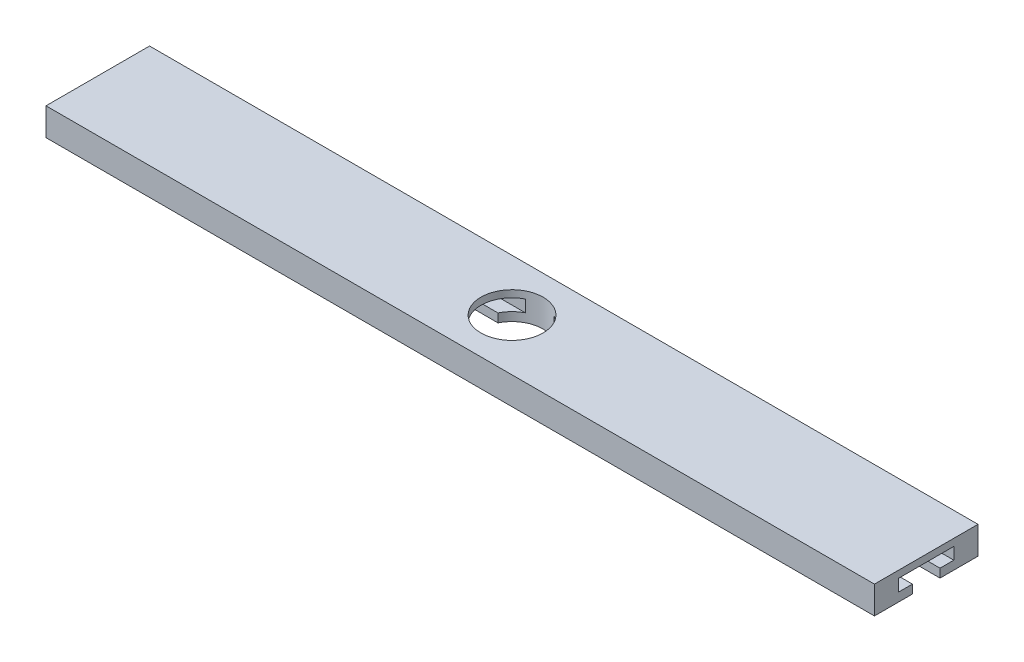
ISO-10303-21;
HEADER;
FILE_DESCRIPTION(('STEP AP214'),'2;1');
FILE_NAME('part.step','',(''),(''),'','','');
FILE_SCHEMA(('AUTOMOTIVE_DESIGN { 1 0 10303 214 1 1 1 1 }'));
ENDSEC;
DATA;
#1=APPLICATION_CONTEXT('core data for automotive mechanical design processes');
#2=APPLICATION_PROTOCOL_DEFINITION('international standard','automotive_design',2000,#1);
#3=PRODUCT_CONTEXT('',#1,'mechanical');
#4=PRODUCT('Part','Part','',(#3));
#5=PRODUCT_RELATED_PRODUCT_CATEGORY('part','',(#4));
#6=PRODUCT_DEFINITION_FORMATION('','',#4);
#7=PRODUCT_DEFINITION_CONTEXT('part definition',#1,'design');
#8=PRODUCT_DEFINITION('design','',#6,#7);
#9=PRODUCT_DEFINITION_SHAPE('','',#8);
#10=(LENGTH_UNIT() NAMED_UNIT(*) SI_UNIT(.MILLI.,.METRE.));
#11=(NAMED_UNIT(*) PLANE_ANGLE_UNIT() SI_UNIT($,.RADIAN.));
#12=(NAMED_UNIT(*) SI_UNIT($,.STERADIAN.) SOLID_ANGLE_UNIT());
#13=UNCERTAINTY_MEASURE_WITH_UNIT(LENGTH_MEASURE(1.E-05),#10,'distance_accuracy_value','');
#14=(GEOMETRIC_REPRESENTATION_CONTEXT(3) GLOBAL_UNCERTAINTY_ASSIGNED_CONTEXT((#13)) GLOBAL_UNIT_ASSIGNED_CONTEXT((#10,
#11,#12)) REPRESENTATION_CONTEXT('',''));
#15=CARTESIAN_POINT('',(0.,0.,0.));
#16=DIRECTION('',(0.,0.,1.));
#17=DIRECTION('',(1.,0.,0.));
#18=AXIS2_PLACEMENT_3D('',#15,#16,#17);
#19=CARTESIAN_POINT('',(27.,30.4474858159156,9.5));
#20=DIRECTION('',(0.,0.,-1.));
#21=DIRECTION('',(-1.,0.,0.));
#22=AXIS2_PLACEMENT_3D('',#19,#20,#21);
#23=PLANE('',#22);
#24=DIRECTION('',(-1.,0.,0.));
#25=VECTOR('',#24,1.);
#26=CARTESIAN_POINT('',(27.,30.4474858159156,9.5));
#27=LINE('',#26,#25);
#28=CARTESIAN_POINT('',(20.7315085104506,30.4474858159156,9.5));
#29=VERTEX_POINT('',#28);
#30=CARTESIAN_POINT('',(-35.2373626154001,30.4474858159156,9.5));
#31=VERTEX_POINT('',#30);
#32=EDGE_CURVE('E180',#29,#31,#27,.T.);
#33=ORIENTED_EDGE('',*,*,#32,.T.);
#34=DIRECTION('',(0.,-1.,0.));
#35=VECTOR('',#34,1.);
#36=CARTESIAN_POINT('',(-35.2373626154001,44.,9.5));
#37=LINE('',#36,#35);
#38=CARTESIAN_POINT('',(-35.2373626154001,31.6992332383739,9.5));
#39=VERTEX_POINT('',#38);
#40=EDGE_CURVE('E170',#31,#39,#37,.F.);
#41=ORIENTED_EDGE('',*,*,#40,.T.);
#42=DIRECTION('',(-1.,0.,0.));
#43=VECTOR('',#42,1.);
#44=CARTESIAN_POINT('',(27.,31.6992332383739,9.5));
#45=LINE('',#44,#43);
#46=CARTESIAN_POINT('',(20.7315085104506,31.6992332383739,9.5));
#47=VERTEX_POINT('',#46);
#48=EDGE_CURVE('E177',#47,#39,#45,.T.);
#49=ORIENTED_EDGE('',*,*,#48,.F.);
#50=DIRECTION('',(0.,-1.,0.));
#51=VECTOR('',#50,1.);
#52=CARTESIAN_POINT('',(20.7315085104506,30.4474858159156,9.5));
#53=LINE('',#52,#51);
#54=EDGE_CURVE('E173',#47,#29,#53,.T.);
#55=ORIENTED_EDGE('',*,*,#54,.T.);
#56=EDGE_LOOP('',(#33,#41,#49,#55));
#57=FACE_BOUND('',#56,.T.);
#58=ADVANCED_FACE('F33',(#57),#23,.T.);
#59=CARTESIAN_POINT('',(-43.2996203636986,31.6992332383739,9.5));
#60=VERTEX_POINT('',#59);
#61=CARTESIAN_POINT('',(-99.2684914895494,31.6992332383739,9.5));
#62=VERTEX_POINT('',#61);
#63=EDGE_CURVE('E188',#60,#62,#45,.T.);
#64=ORIENTED_EDGE('',*,*,#63,.F.);
#65=DIRECTION('',(0.,-1.,0.));
#66=VECTOR('',#65,1.);
#67=CARTESIAN_POINT('',(-43.2996203636986,44.,9.5));
#68=LINE('',#67,#66);
#69=CARTESIAN_POINT('',(-43.2996203636986,30.4474858159156,9.5));
#70=VERTEX_POINT('',#69);
#71=EDGE_CURVE('E304',#60,#70,#68,.T.);
#72=ORIENTED_EDGE('',*,*,#71,.T.);
#73=CARTESIAN_POINT('',(-99.2684914895494,30.4474858159156,9.5));
#74=VERTEX_POINT('',#73);
#75=EDGE_CURVE('E215',#70,#74,#27,.T.);
#76=ORIENTED_EDGE('',*,*,#75,.T.);
#77=DIRECTION('',(0.,1.,0.));
#78=VECTOR('',#77,1.);
#79=CARTESIAN_POINT('',(-99.2684914895493,34.4474858159156,9.5));
#80=LINE('',#79,#78);
#81=EDGE_CURVE('E235',#74,#62,#80,.T.);
#82=ORIENTED_EDGE('',*,*,#81,.T.);
#83=EDGE_LOOP('',(#64,#72,#76,#82));
#84=FACE_BOUND('',#83,.T.);
#85=ADVANCED_FACE('F302',(#84),#23,.T.);
#86=CARTESIAN_POINT('',(27.,31.6992332383739,5.5));
#87=DIRECTION('',(0.,0.,1.));
#88=DIRECTION('',(1.,0.,0.));
#89=AXIS2_PLACEMENT_3D('',#86,#87,#88);
#90=PLANE('',#89);
#91=DIRECTION('',(-1.,0.,0.));
#92=VECTOR('',#91,1.);
#93=CARTESIAN_POINT('',(27.,30.4474858159156,5.5));
#94=LINE('',#93,#92);
#95=CARTESIAN_POINT('',(-43.2996203636986,30.4474858159156,5.5));
#96=VERTEX_POINT('',#95);
#97=CARTESIAN_POINT('',(-99.2684914895494,30.4474858159156,5.5));
#98=VERTEX_POINT('',#97);
#99=EDGE_CURVE('E211',#96,#98,#94,.T.);
#100=ORIENTED_EDGE('',*,*,#99,.F.);
#101=DIRECTION('',(0.,-1.,0.));
#102=VECTOR('',#101,1.);
#103=CARTESIAN_POINT('',(-43.2996203636986,44.,5.5));
#104=LINE('',#103,#102);
#105=CARTESIAN_POINT('',(-43.2996203636986,31.6992332383739,5.5));
#106=VERTEX_POINT('',#105);
#107=EDGE_CURVE('E306',#96,#106,#104,.F.);
#108=ORIENTED_EDGE('',*,*,#107,.T.);
#109=DIRECTION('',(-1.,0.,0.));
#110=VECTOR('',#109,1.);
#111=CARTESIAN_POINT('',(27.,31.6992332383739,5.5));
#112=LINE('',#111,#110);
#113=CARTESIAN_POINT('',(-99.2684914895494,31.6992332383739,5.5));
#114=VERTEX_POINT('',#113);
#115=EDGE_CURVE('E207',#106,#114,#112,.T.);
#116=ORIENTED_EDGE('',*,*,#115,.T.);
#117=DIRECTION('',(0.,-1.,0.));
#118=VECTOR('',#117,1.);
#119=CARTESIAN_POINT('',(-99.2684914895493,34.4474858159156,5.5));
#120=LINE('',#119,#118);
#121=EDGE_CURVE('E232',#114,#98,#120,.T.);
#122=ORIENTED_EDGE('',*,*,#121,.T.);
#123=EDGE_LOOP('',(#100,#108,#116,#122));
#124=FACE_BOUND('',#123,.T.);
#125=ADVANCED_FACE('F372',(#124),#90,.T.);
#126=CARTESIAN_POINT('',(20.7315085104506,31.6992332383739,5.5));
#127=VERTEX_POINT('',#126);
#128=CARTESIAN_POINT('',(-35.2373626154001,31.6992332383739,5.5));
#129=VERTEX_POINT('',#128);
#130=EDGE_CURVE('E208',#127,#129,#112,.T.);
#131=ORIENTED_EDGE('',*,*,#130,.T.);
#132=DIRECTION('',(0.,-1.,0.));
#133=VECTOR('',#132,1.);
#134=CARTESIAN_POINT('',(-35.2373626154001,44.,5.5));
#135=LINE('',#134,#133);
#136=CARTESIAN_POINT('',(-35.2373626154001,30.4474858159156,5.5));
#137=VERTEX_POINT('',#136);
#138=EDGE_CURVE('E182',#129,#137,#135,.T.);
#139=ORIENTED_EDGE('',*,*,#138,.T.);
#140=CARTESIAN_POINT('',(20.7315085104506,30.4474858159156,5.5));
#141=VERTEX_POINT('',#140);
#142=EDGE_CURVE('E212',#141,#137,#94,.T.);
#143=ORIENTED_EDGE('',*,*,#142,.F.);
#144=DIRECTION('',(0.,1.,0.));
#145=VECTOR('',#144,1.);
#146=CARTESIAN_POINT('',(20.7315085104506,30.4474858159156,5.5));
#147=LINE('',#146,#145);
#148=EDGE_CURVE('E280',#141,#127,#147,.T.);
#149=ORIENTED_EDGE('',*,*,#148,.T.);
#150=EDGE_LOOP('',(#131,#139,#143,#149));
#151=FACE_BOUND('',#150,.T.);
#152=ADVANCED_FACE('F353',(#151),#90,.T.);
#153=CARTESIAN_POINT('',(27.,31.6992332383739,3.5));
#154=DIRECTION('',(0.,1.,0.));
#155=DIRECTION('',(0.,0.,1.));
#156=AXIS2_PLACEMENT_3D('',#153,#154,#155);
#157=PLANE('',#156);
#158=ORIENTED_EDGE('',*,*,#115,.F.);
#159=CARTESIAN_POINT('',(-39.2684914895494,31.6992332383739,7.5));
#160=DIRECTION('',(0.,1.,0.));
#161=DIRECTION('',(0.,0.,1.));
#162=AXIS2_PLACEMENT_3D('',#159,#160,#161);
#163=CIRCLE('',#162,4.5);
#164=CARTESIAN_POINT('',(-41.3300443023582,31.6992332383739,3.5));
#165=VERTEX_POINT('',#164);
#166=EDGE_CURVE('E316',#106,#165,#163,.F.);
#167=ORIENTED_EDGE('',*,*,#166,.T.);
#168=DIRECTION('',(-1.,0.,0.));
#169=VECTOR('',#168,1.);
#170=CARTESIAN_POINT('',(27.,31.6992332383739,3.5));
#171=LINE('',#170,#169);
#172=CARTESIAN_POINT('',(-99.2684914895494,31.6992332383739,3.5));
#173=VERTEX_POINT('',#172);
#174=EDGE_CURVE('E203',#165,#173,#171,.T.);
#175=ORIENTED_EDGE('',*,*,#174,.T.);
#176=DIRECTION('',(0.,0.,1.));
#177=VECTOR('',#176,1.);
#178=CARTESIAN_POINT('',(-99.2684914895493,31.6992332383739,15.));
#179=LINE('',#178,#177);
#180=EDGE_CURVE('E229',#173,#114,#179,.T.);
#181=ORIENTED_EDGE('',*,*,#180,.T.);
#182=EDGE_LOOP('',(#158,#167,#175,#181));
#183=FACE_BOUND('',#182,.T.);
#184=ADVANCED_FACE('F375',(#183),#157,.T.);
#185=CARTESIAN_POINT('',(27.,33.4295680375443,3.5));
#186=DIRECTION('',(0.,0.,1.));
#187=DIRECTION('',(1.,0.,0.));
#188=AXIS2_PLACEMENT_3D('',#185,#186,#187);
#189=PLANE('',#188);
#190=ORIENTED_EDGE('',*,*,#174,.F.);
#191=DIRECTION('',(0.,-1.,0.));
#192=VECTOR('',#191,1.);
#193=CARTESIAN_POINT('',(-41.3300443023582,44.,3.5));
#194=LINE('',#193,#192);
#195=CARTESIAN_POINT('',(-41.3300443023582,33.4295680375443,3.5));
#196=VERTEX_POINT('',#195);
#197=EDGE_CURVE('E314',#165,#196,#194,.F.);
#198=ORIENTED_EDGE('',*,*,#197,.T.);
#199=DIRECTION('',(-1.,0.,0.));
#200=VECTOR('',#199,1.);
#201=CARTESIAN_POINT('',(27.,33.4295680375443,3.5));
#202=LINE('',#201,#200);
#203=CARTESIAN_POINT('',(-99.2684914895494,33.4295680375443,3.5));
#204=VERTEX_POINT('',#203);
#205=EDGE_CURVE('E199',#196,#204,#202,.T.);
#206=ORIENTED_EDGE('',*,*,#205,.T.);
#207=DIRECTION('',(0.,-1.,0.));
#208=VECTOR('',#207,1.);
#209=CARTESIAN_POINT('',(-99.2684914895493,34.4474858159156,3.5));
#210=LINE('',#209,#208);
#211=EDGE_CURVE('E226',#204,#173,#210,.T.);
#212=ORIENTED_EDGE('',*,*,#211,.T.);
#213=EDGE_LOOP('',(#190,#198,#206,#212));
#214=FACE_BOUND('',#213,.T.);
#215=ADVANCED_FACE('F376',(#214),#189,.T.);
#216=CARTESIAN_POINT('',(20.7315085104506,33.4295680375443,3.5));
#217=VERTEX_POINT('',#216);
#218=CARTESIAN_POINT('',(-37.2069386767405,33.4295680375443,3.5));
#219=VERTEX_POINT('',#218);
#220=EDGE_CURVE('E200',#217,#219,#202,.T.);
#221=ORIENTED_EDGE('',*,*,#220,.T.);
#222=DIRECTION('',(0.,-1.,0.));
#223=VECTOR('',#222,1.);
#224=CARTESIAN_POINT('',(-37.2069386767405,44.,3.5));
#225=LINE('',#224,#223);
#226=CARTESIAN_POINT('',(-37.2069386767405,31.6992332383739,3.5));
#227=VERTEX_POINT('',#226);
#228=EDGE_CURVE('E331',#219,#227,#225,.T.);
#229=ORIENTED_EDGE('',*,*,#228,.T.);
#230=CARTESIAN_POINT('',(20.7315085104506,31.6992332383739,3.5));
#231=VERTEX_POINT('',#230);
#232=EDGE_CURVE('E204',#231,#227,#171,.T.);
#233=ORIENTED_EDGE('',*,*,#232,.F.);
#234=DIRECTION('',(0.,1.,0.));
#235=VECTOR('',#234,1.);
#236=CARTESIAN_POINT('',(20.7315085104506,30.4474858159156,3.5));
#237=LINE('',#236,#235);
#238=EDGE_CURVE('E276',#231,#217,#237,.T.);
#239=ORIENTED_EDGE('',*,*,#238,.T.);
#240=EDGE_LOOP('',(#221,#229,#233,#239));
#241=FACE_BOUND('',#240,.T.);
#242=ADVANCED_FACE('F346',(#241),#189,.T.);
#243=CARTESIAN_POINT('',(27.,33.4295680375443,11.5));
#244=DIRECTION('',(0.,-1.,0.));
#245=DIRECTION('',(0.,0.,-1.));
#246=AXIS2_PLACEMENT_3D('',#243,#244,#245);
#247=PLANE('',#246);
#248=ORIENTED_EDGE('',*,*,#205,.F.);
#249=CARTESIAN_POINT('',(-39.2684914895494,33.4295680375443,7.5));
#250=DIRECTION('',(0.,-1.,0.));
#251=DIRECTION('',(0.,0.,-1.));
#252=AXIS2_PLACEMENT_3D('',#249,#250,#251);
#253=CIRCLE('',#252,4.5);
#254=CARTESIAN_POINT('',(-41.3300443023582,33.4295680375443,11.5));
#255=VERTEX_POINT('',#254);
#256=EDGE_CURVE('E309',#196,#255,#253,.F.);
#257=ORIENTED_EDGE('',*,*,#256,.T.);
#258=DIRECTION('',(-1.,0.,0.));
#259=VECTOR('',#258,1.);
#260=CARTESIAN_POINT('',(27.,33.4295680375443,11.5));
#261=LINE('',#260,#259);
#262=CARTESIAN_POINT('',(-99.2684914895494,33.4295680375443,11.5));
#263=VERTEX_POINT('',#262);
#264=EDGE_CURVE('E195',#255,#263,#261,.T.);
#265=ORIENTED_EDGE('',*,*,#264,.T.);
#266=DIRECTION('',(0.,0.,-1.));
#267=VECTOR('',#266,1.);
#268=CARTESIAN_POINT('',(-99.2684914895493,33.4295680375443,15.));
#269=LINE('',#268,#267);
#270=EDGE_CURVE('E223',#263,#204,#269,.T.);
#271=ORIENTED_EDGE('',*,*,#270,.T.);
#272=EDGE_LOOP('',(#248,#257,#265,#271));
#273=FACE_BOUND('',#272,.T.);
#274=ADVANCED_FACE('F378',(#273),#247,.T.);
#275=CARTESIAN_POINT('',(27.,31.6992332383739,11.5));
#276=DIRECTION('',(0.,0.,-1.));
#277=DIRECTION('',(-1.,0.,0.));
#278=AXIS2_PLACEMENT_3D('',#275,#276,#277);
#279=PLANE('',#278);
#280=DIRECTION('',(-1.,0.,0.));
#281=VECTOR('',#280,1.);
#282=CARTESIAN_POINT('',(27.,31.6992332383739,11.5));
#283=LINE('',#282,#281);
#284=CARTESIAN_POINT('',(20.7315085104506,31.6992332383739,11.5));
#285=VERTEX_POINT('',#284);
#286=CARTESIAN_POINT('',(-37.2069386767405,31.6992332383739,11.5));
#287=VERTEX_POINT('',#286);
#288=EDGE_CURVE('E55',#285,#287,#283,.T.);
#289=ORIENTED_EDGE('',*,*,#288,.T.);
#290=DIRECTION('',(0.,-1.,0.));
#291=VECTOR('',#290,1.);
#292=CARTESIAN_POINT('',(-37.2069386767405,44.,11.5));
#293=LINE('',#292,#291);
#294=CARTESIAN_POINT('',(-37.2069386767405,33.4295680375443,11.5));
#295=VERTEX_POINT('',#294);
#296=EDGE_CURVE('E48',#287,#295,#293,.F.);
#297=ORIENTED_EDGE('',*,*,#296,.T.);
#298=CARTESIAN_POINT('',(20.7315085104506,33.4295680375443,11.5));
#299=VERTEX_POINT('',#298);
#300=EDGE_CURVE('E196',#299,#295,#261,.T.);
#301=ORIENTED_EDGE('',*,*,#300,.F.);
#302=DIRECTION('',(0.,-1.,0.));
#303=VECTOR('',#302,1.);
#304=CARTESIAN_POINT('',(20.7315085104506,30.4474858159156,11.5));
#305=LINE('',#304,#303);
#306=EDGE_CURVE('E272',#299,#285,#305,.T.);
#307=ORIENTED_EDGE('',*,*,#306,.T.);
#308=EDGE_LOOP('',(#289,#297,#301,#307));
#309=FACE_BOUND('',#308,.T.);
#310=ADVANCED_FACE('F337',(#309),#279,.T.);
#311=ORIENTED_EDGE('',*,*,#264,.F.);
#312=DIRECTION('',(0.,-1.,0.));
#313=VECTOR('',#312,1.);
#314=CARTESIAN_POINT('',(-41.3300443023582,44.,11.5));
#315=LINE('',#314,#313);
#316=CARTESIAN_POINT('',(-41.3300443023582,31.6992332383739,11.5));
#317=VERTEX_POINT('',#316);
#318=EDGE_CURVE('E305',#255,#317,#315,.T.);
#319=ORIENTED_EDGE('',*,*,#318,.T.);
#320=CARTESIAN_POINT('',(-99.2684914895494,31.6992332383739,11.5));
#321=VERTEX_POINT('',#320);
#322=EDGE_CURVE('E187',#317,#321,#283,.T.);
#323=ORIENTED_EDGE('',*,*,#322,.T.);
#324=DIRECTION('',(0.,1.,0.));
#325=VECTOR('',#324,1.);
#326=CARTESIAN_POINT('',(-99.2684914895493,34.4474858159156,11.5));
#327=LINE('',#326,#325);
#328=EDGE_CURVE('E220',#321,#263,#327,.T.);
#329=ORIENTED_EDGE('',*,*,#328,.T.);
#330=EDGE_LOOP('',(#311,#319,#323,#329));
#331=FACE_BOUND('',#330,.T.);
#332=ADVANCED_FACE('F380',(#331),#279,.T.);
#333=CARTESIAN_POINT('',(27.,31.6992332383739,9.5));
#334=DIRECTION('',(0.,1.,0.));
#335=DIRECTION('',(0.,0.,1.));
#336=AXIS2_PLACEMENT_3D('',#333,#334,#335);
#337=PLANE('',#336);
#338=ORIENTED_EDGE('',*,*,#322,.F.);
#339=CARTESIAN_POINT('',(-39.2684914895494,31.6992332383739,7.5));
#340=DIRECTION('',(0.,1.,0.));
#341=DIRECTION('',(0.,0.,1.));
#342=AXIS2_PLACEMENT_3D('',#339,#340,#341);
#343=CIRCLE('',#342,4.5);
#344=EDGE_CURVE('E11',#317,#60,#343,.F.);
#345=ORIENTED_EDGE('',*,*,#344,.T.);
#346=ORIENTED_EDGE('',*,*,#63,.T.);
#347=DIRECTION('',(0.,0.,1.));
#348=VECTOR('',#347,1.);
#349=CARTESIAN_POINT('',(-99.2684914895493,31.6992332383739,15.));
#350=LINE('',#349,#348);
#351=EDGE_CURVE('E217',#62,#321,#350,.T.);
#352=ORIENTED_EDGE('',*,*,#351,.T.);
#353=EDGE_LOOP('',(#338,#345,#346,#352));
#354=FACE_BOUND('',#353,.T.);
#355=ADVANCED_FACE('F383',(#354),#337,.T.);
#356=CARTESIAN_POINT('',(-99.2684914895493,34.4474858159156,15.));
#357=DIRECTION('',(1.,0.,0.));
#358=DIRECTION('',(0.,0.,-1.));
#359=AXIS2_PLACEMENT_3D('',#356,#357,#358);
#360=PLANE('',#359);
#361=ORIENTED_EDGE('',*,*,#81,.F.);
#362=DIRECTION('',(0.,0.,-1.));
#363=VECTOR('',#362,1.);
#364=CARTESIAN_POINT('',(-99.2684914895493,30.4474858159156,15.));
#365=LINE('',#364,#363);
#366=CARTESIAN_POINT('',(-99.2684914895493,30.4474858159156,15.));
#367=VERTEX_POINT('',#366);
#368=EDGE_CURVE('E268',#367,#74,#365,.T.);
#369=ORIENTED_EDGE('',*,*,#368,.F.);
#370=DIRECTION('',(0.,-1.,0.));
#371=VECTOR('',#370,1.);
#372=CARTESIAN_POINT('',(-99.2684914895493,34.4474858159156,15.));
#373=LINE('',#372,#371);
#374=CARTESIAN_POINT('',(-99.2684914895493,34.4474858159156,15.));
#375=VERTEX_POINT('',#374);
#376=EDGE_CURVE('E239',#375,#367,#373,.T.);
#377=ORIENTED_EDGE('',*,*,#376,.F.);
#378=DIRECTION('',(0.,0.,-1.));
#379=VECTOR('',#378,1.);
#380=CARTESIAN_POINT('',(-99.2684914895493,34.4474858159156,15.));
#381=LINE('',#380,#379);
#382=CARTESIAN_POINT('',(-99.2684914895493,34.4474858159156,0.));
#383=VERTEX_POINT('',#382);
#384=EDGE_CURVE('E249',#375,#383,#381,.T.);
#385=ORIENTED_EDGE('',*,*,#384,.T.);
#386=DIRECTION('',(0.,-1.,0.));
#387=VECTOR('',#386,1.);
#388=CARTESIAN_POINT('',(-99.2684914895493,34.4474858159156,0.));
#389=LINE('',#388,#387);
#390=CARTESIAN_POINT('',(-99.2684914895493,30.4474858159156,0.));
#391=VERTEX_POINT('',#390);
#392=EDGE_CURVE('E238',#383,#391,#389,.T.);
#393=ORIENTED_EDGE('',*,*,#392,.T.);
#394=EDGE_CURVE('E267',#98,#391,#365,.T.);
#395=ORIENTED_EDGE('',*,*,#394,.F.);
#396=ORIENTED_EDGE('',*,*,#121,.F.);
#397=ORIENTED_EDGE('',*,*,#180,.F.);
#398=ORIENTED_EDGE('',*,*,#211,.F.);
#399=ORIENTED_EDGE('',*,*,#270,.F.);
#400=ORIENTED_EDGE('',*,*,#328,.F.);
#401=ORIENTED_EDGE('',*,*,#351,.F.);
#402=EDGE_LOOP('',(#361,#369,#377,#385,#393,#395,#396,#397,#398,#399,#400,#401));
#403=FACE_BOUND('',#402,.T.);
#404=ADVANCED_FACE('F35',(#403),#360,.F.);
#405=CARTESIAN_POINT('',(-99.2684914895493,30.4474858159156,15.));
#406=DIRECTION('',(0.,1.,0.));
#407=DIRECTION('',(0.,0.,1.));
#408=AXIS2_PLACEMENT_3D('',#405,#406,#407);
#409=PLANE('',#408);
#410=CARTESIAN_POINT('',(-39.2684914895494,30.4474858159156,7.5));
#411=DIRECTION('',(0.,1.,0.));
#412=DIRECTION('',(0.,0.,1.));
#413=AXIS2_PLACEMENT_3D('',#410,#411,#412);
#414=CIRCLE('',#413,4.5);
#415=EDGE_CURVE('E287',#31,#70,#414,.F.);
#416=ORIENTED_EDGE('',*,*,#415,.F.);
#417=ORIENTED_EDGE('',*,*,#32,.F.);
#418=DIRECTION('',(0.,0.,-1.));
#419=VECTOR('',#418,1.);
#420=CARTESIAN_POINT('',(20.7315085104506,30.4474858159156,15.));
#421=LINE('',#420,#419);
#422=CARTESIAN_POINT('',(20.7315085104506,30.4474858159156,15.));
#423=VERTEX_POINT('',#422);
#424=EDGE_CURVE('E264',#423,#29,#421,.T.);
#425=ORIENTED_EDGE('',*,*,#424,.F.);
#426=DIRECTION('',(1.,0.,0.));
#427=VECTOR('',#426,1.);
#428=CARTESIAN_POINT('',(-99.2684914895493,30.4474858159156,15.));
#429=LINE('',#428,#427);
#430=EDGE_CURVE('E242',#367,#423,#429,.T.);
#431=ORIENTED_EDGE('',*,*,#430,.F.);
#432=ORIENTED_EDGE('',*,*,#368,.T.);
#433=ORIENTED_EDGE('',*,*,#75,.F.);
#434=EDGE_LOOP('',(#416,#417,#425,#431,#432,#433));
#435=FACE_BOUND('',#434,.T.);
#436=ADVANCED_FACE('F284',(#435),#409,.F.);
#437=CARTESIAN_POINT('',(-39.2684914895494,30.4474858159156,7.5));
#438=DIRECTION('',(0.,1.,0.));
#439=DIRECTION('',(0.,0.,1.));
#440=AXIS2_PLACEMENT_3D('',#437,#438,#439);
#441=CIRCLE('',#440,4.5);
#442=EDGE_CURVE('E181',#96,#137,#441,.F.);
#443=ORIENTED_EDGE('',*,*,#442,.F.);
#444=ORIENTED_EDGE('',*,*,#99,.T.);
#445=ORIENTED_EDGE('',*,*,#394,.T.);
#446=DIRECTION('',(1.,0.,0.));
#447=VECTOR('',#446,1.);
#448=CARTESIAN_POINT('',(-99.2684914895493,30.4474858159156,0.));
#449=LINE('',#448,#447);
#450=CARTESIAN_POINT('',(20.7315085104506,30.4474858159156,0.));
#451=VERTEX_POINT('',#450);
#452=EDGE_CURVE('E252',#391,#451,#449,.T.);
#453=ORIENTED_EDGE('',*,*,#452,.T.);
#454=EDGE_CURVE('E263',#141,#451,#421,.T.);
#455=ORIENTED_EDGE('',*,*,#454,.F.);
#456=ORIENTED_EDGE('',*,*,#142,.T.);
#457=EDGE_LOOP('',(#443,#444,#445,#453,#455,#456));
#458=FACE_BOUND('',#457,.T.);
#459=ADVANCED_FACE('F357',(#458),#409,.F.);
#460=CARTESIAN_POINT('',(20.7315085104506,30.4474858159156,15.));
#461=DIRECTION('',(-1.,0.,0.));
#462=DIRECTION('',(0.,-1.,0.));
#463=AXIS2_PLACEMENT_3D('',#460,#461,#462);
#464=PLANE('',#463);
#465=ORIENTED_EDGE('',*,*,#54,.F.);
#466=DIRECTION('',(0.,0.,-1.));
#467=VECTOR('',#466,1.);
#468=CARTESIAN_POINT('',(20.7315085104506,31.6992332383739,15.));
#469=LINE('',#468,#467);
#470=EDGE_CURVE('E186',#285,#47,#469,.T.);
#471=ORIENTED_EDGE('',*,*,#470,.F.);
#472=ORIENTED_EDGE('',*,*,#306,.F.);
#473=DIRECTION('',(0.,0.,1.));
#474=VECTOR('',#473,1.);
#475=CARTESIAN_POINT('',(20.7315085104506,33.4295680375443,15.));
#476=LINE('',#475,#474);
#477=EDGE_CURVE('E274',#217,#299,#476,.T.);
#478=ORIENTED_EDGE('',*,*,#477,.F.);
#479=ORIENTED_EDGE('',*,*,#238,.F.);
#480=DIRECTION('',(0.,0.,-1.));
#481=VECTOR('',#480,1.);
#482=CARTESIAN_POINT('',(20.7315085104506,31.6992332383739,15.));
#483=LINE('',#482,#481);
#484=EDGE_CURVE('E278',#127,#231,#483,.T.);
#485=ORIENTED_EDGE('',*,*,#484,.F.);
#486=ORIENTED_EDGE('',*,*,#148,.F.);
#487=ORIENTED_EDGE('',*,*,#454,.T.);
#488=DIRECTION('',(0.,1.,0.));
#489=VECTOR('',#488,1.);
#490=CARTESIAN_POINT('',(20.7315085104506,30.4474858159156,0.));
#491=LINE('',#490,#489);
#492=CARTESIAN_POINT('',(20.7315085104506,34.4474858159156,0.));
#493=VERTEX_POINT('',#492);
#494=EDGE_CURVE('E255',#451,#493,#491,.T.);
#495=ORIENTED_EDGE('',*,*,#494,.T.);
#496=DIRECTION('',(0.,0.,-1.));
#497=VECTOR('',#496,1.);
#498=CARTESIAN_POINT('',(20.7315085104506,34.4474858159156,15.));
#499=LINE('',#498,#497);
#500=CARTESIAN_POINT('',(20.7315085104506,34.4474858159156,15.));
#501=VERTEX_POINT('',#500);
#502=EDGE_CURVE('E260',#501,#493,#499,.T.);
#503=ORIENTED_EDGE('',*,*,#502,.F.);
#504=DIRECTION('',(0.,1.,0.));
#505=VECTOR('',#504,1.);
#506=CARTESIAN_POINT('',(20.7315085104506,30.4474858159156,15.));
#507=LINE('',#506,#505);
#508=EDGE_CURVE('E245',#423,#501,#507,.T.);
#509=ORIENTED_EDGE('',*,*,#508,.F.);
#510=ORIENTED_EDGE('',*,*,#424,.T.);
#511=EDGE_LOOP('',(#465,#471,#472,#478,#479,#485,#486,#487,#495,#503,#509,#510));
#512=FACE_BOUND('',#511,.T.);
#513=ADVANCED_FACE('F288',(#512),#464,.F.);
#514=CARTESIAN_POINT('',(-99.2684914895493,34.4474858159156,15.));
#515=DIRECTION('',(0.,-1.,0.));
#516=DIRECTION('',(0.,0.,-1.));
#517=AXIS2_PLACEMENT_3D('',#514,#515,#516);
#518=PLANE('',#517);
#519=CARTESIAN_POINT('',(-39.2684914895494,34.4474858159156,7.5));
#520=DIRECTION('',(0.,-1.,0.));
#521=DIRECTION('',(0.,0.,-1.));
#522=AXIS2_PLACEMENT_3D('',#519,#520,#521);
#523=CIRCLE('',#522,4.5);
#524=CARTESIAN_POINT('',(-39.2684914895494,34.4474858159156,3.));
#525=VERTEX_POINT('',#524);
#526=EDGE_CURVE('E191',#525,#525,#523,.F.);
#527=ORIENTED_EDGE('',*,*,#526,.F.);
#528=EDGE_LOOP('',(#527));
#529=FACE_BOUND('',#528,.T.);
#530=DIRECTION('',(-1.,0.,0.));
#531=VECTOR('',#530,1.);
#532=CARTESIAN_POINT('',(-99.2684914895493,34.4474858159156,0.));
#533=LINE('',#532,#531);
#534=EDGE_CURVE('E243',#493,#383,#533,.T.);
#535=ORIENTED_EDGE('',*,*,#534,.T.);
#536=ORIENTED_EDGE('',*,*,#384,.F.);
#537=DIRECTION('',(-1.,0.,0.));
#538=VECTOR('',#537,1.);
#539=CARTESIAN_POINT('',(-99.2684914895493,34.4474858159156,15.));
#540=LINE('',#539,#538);
#541=EDGE_CURVE('E247',#501,#375,#540,.T.);
#542=ORIENTED_EDGE('',*,*,#541,.F.);
#543=ORIENTED_EDGE('',*,*,#502,.T.);
#544=EDGE_LOOP('',(#535,#536,#542,#543));
#545=FACE_BOUND('',#544,.T.);
#546=ADVANCED_FACE('F366',(#529,#545),#518,.F.);
#547=CARTESIAN_POINT('',(0.,0.,15.));
#548=DIRECTION('',(0.,0.,1.));
#549=DIRECTION('',(1.,0.,0.));
#550=AXIS2_PLACEMENT_3D('',#547,#548,#549);
#551=PLANE('',#550);
#552=ORIENTED_EDGE('',*,*,#376,.T.);
#553=ORIENTED_EDGE('',*,*,#430,.T.);
#554=ORIENTED_EDGE('',*,*,#508,.T.);
#555=ORIENTED_EDGE('',*,*,#541,.T.);
#556=EDGE_LOOP('',(#552,#553,#554,#555));
#557=FACE_BOUND('',#556,.T.);
#558=ADVANCED_FACE('F292',(#557),#551,.T.);
#559=CARTESIAN_POINT('',(0.,0.,0.));
#560=DIRECTION('',(0.,0.,1.));
#561=DIRECTION('',(1.,0.,0.));
#562=AXIS2_PLACEMENT_3D('',#559,#560,#561);
#563=PLANE('',#562);
#564=ORIENTED_EDGE('',*,*,#392,.F.);
#565=ORIENTED_EDGE('',*,*,#534,.F.);
#566=ORIENTED_EDGE('',*,*,#494,.F.);
#567=ORIENTED_EDGE('',*,*,#452,.F.);
#568=EDGE_LOOP('',(#564,#565,#566,#567));
#569=FACE_BOUND('',#568,.T.);
#570=ADVANCED_FACE('F364',(#569),#563,.F.);
#571=ORIENTED_EDGE('',*,*,#232,.T.);
#572=EDGE_CURVE('E322',#227,#129,#163,.F.);
#573=ORIENTED_EDGE('',*,*,#572,.T.);
#574=ORIENTED_EDGE('',*,*,#130,.F.);
#575=ORIENTED_EDGE('',*,*,#484,.T.);
#576=EDGE_LOOP('',(#571,#573,#574,#575));
#577=FACE_BOUND('',#576,.T.);
#578=ADVANCED_FACE('F349',(#577),#157,.T.);
#579=ORIENTED_EDGE('',*,*,#300,.T.);
#580=EDGE_CURVE('E325',#295,#219,#253,.F.);
#581=ORIENTED_EDGE('',*,*,#580,.T.);
#582=ORIENTED_EDGE('',*,*,#220,.F.);
#583=ORIENTED_EDGE('',*,*,#477,.T.);
#584=EDGE_LOOP('',(#579,#581,#582,#583));
#585=FACE_BOUND('',#584,.T.);
#586=ADVANCED_FACE('F339',(#585),#247,.T.);
#587=ORIENTED_EDGE('',*,*,#48,.T.);
#588=EDGE_CURVE('E37',#39,#287,#343,.F.);
#589=ORIENTED_EDGE('',*,*,#588,.T.);
#590=ORIENTED_EDGE('',*,*,#288,.F.);
#591=ORIENTED_EDGE('',*,*,#470,.T.);
#592=EDGE_LOOP('',(#587,#589,#590,#591));
#593=FACE_BOUND('',#592,.T.);
#594=ADVANCED_FACE('F184',(#593),#337,.T.);
#595=CARTESIAN_POINT('',(-39.2684914895494,44.,7.5));
#596=DIRECTION('',(0.,-1.,0.));
#597=DIRECTION('',(0.,0.,-1.));
#598=AXIS2_PLACEMENT_3D('',#595,#596,#597);
#599=CYLINDRICAL_SURFACE('',#598,4.5);
#600=ORIENTED_EDGE('',*,*,#107,.F.);
#601=ORIENTED_EDGE('',*,*,#442,.T.);
#602=ORIENTED_EDGE('',*,*,#138,.F.);
#603=ORIENTED_EDGE('',*,*,#572,.F.);
#604=ORIENTED_EDGE('',*,*,#228,.F.);
#605=ORIENTED_EDGE('',*,*,#580,.F.);
#606=ORIENTED_EDGE('',*,*,#296,.F.);
#607=ORIENTED_EDGE('',*,*,#588,.F.);
#608=ORIENTED_EDGE('',*,*,#40,.F.);
#609=ORIENTED_EDGE('',*,*,#415,.T.);
#610=ORIENTED_EDGE('',*,*,#71,.F.);
#611=ORIENTED_EDGE('',*,*,#344,.F.);
#612=ORIENTED_EDGE('',*,*,#318,.F.);
#613=ORIENTED_EDGE('',*,*,#256,.F.);
#614=ORIENTED_EDGE('',*,*,#197,.F.);
#615=ORIENTED_EDGE('',*,*,#166,.F.);
#616=EDGE_LOOP('',(#600,#601,#602,#603,#604,#605,#606,#607,#608,#609,#610,#611,#612,#613,#614,#615));
#617=FACE_BOUND('',#616,.T.);
#618=ORIENTED_EDGE('',*,*,#526,.T.);
#619=EDGE_LOOP('',(#618));
#620=FACE_BOUND('',#619,.T.);
#621=ADVANCED_FACE('F168',(#617,#620),#599,.F.);
#622=CLOSED_SHELL('',(#58,#85,#125,#152,#184,#215,#242,#274,#310,#332,#355,#404,#436,#459,#513,
#546,#558,#570,#578,#586,#594,#621));
#623=MANIFOLD_SOLID_BREP('B2',#622);
#624=ADVANCED_BREP_SHAPE_REPRESENTATION('',(#18,#623),#14);
#625=SHAPE_DEFINITION_REPRESENTATION(#9,#624);
ENDSEC;
END-ISO-10303-21;
